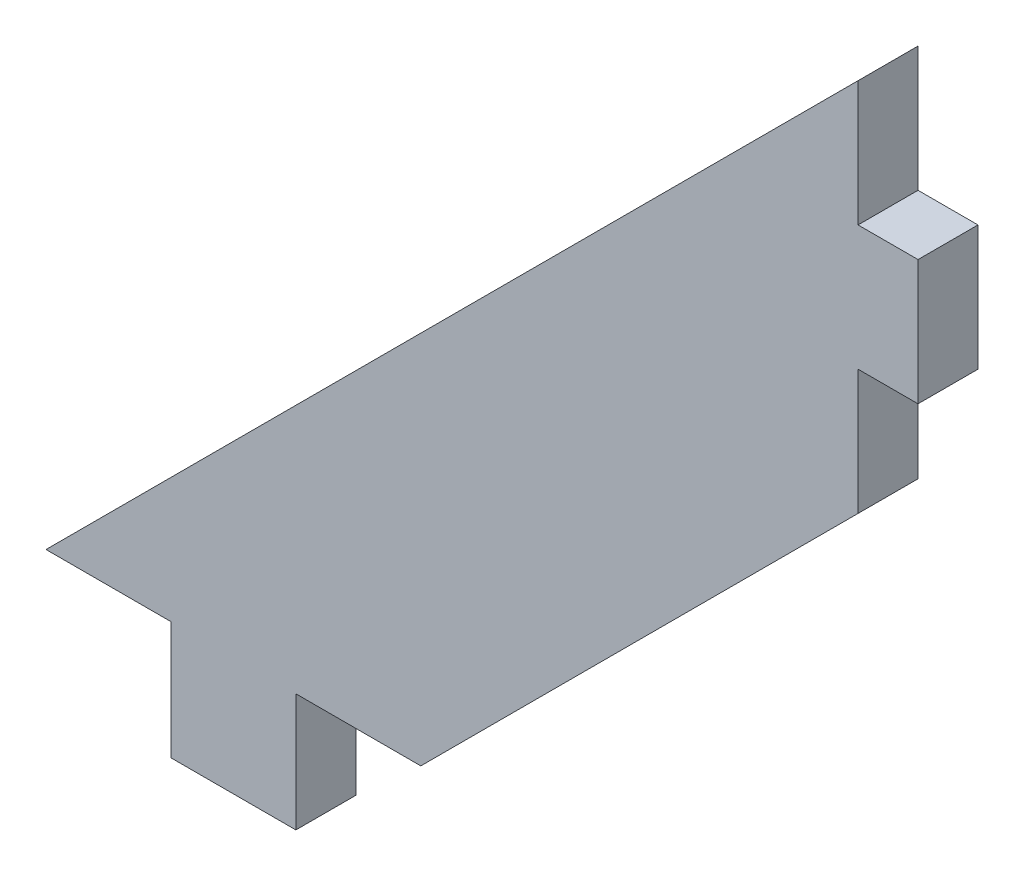
ISO-10303-21;
HEADER;
FILE_DESCRIPTION(('STEP AP214'),'2;1');
FILE_NAME('part.step','',(''),(''),'','','');
FILE_SCHEMA(('AUTOMOTIVE_DESIGN { 1 0 10303 214 1 1 1 1 }'));
ENDSEC;
DATA;
#1=APPLICATION_CONTEXT('core data for automotive mechanical design processes');
#2=APPLICATION_PROTOCOL_DEFINITION('international standard','automotive_design',2000,#1);
#3=PRODUCT_CONTEXT('',#1,'mechanical');
#4=PRODUCT('Part','Part','',(#3));
#5=PRODUCT_RELATED_PRODUCT_CATEGORY('part','',(#4));
#6=PRODUCT_DEFINITION_FORMATION('','',#4);
#7=PRODUCT_DEFINITION_CONTEXT('part definition',#1,'design');
#8=PRODUCT_DEFINITION('design','',#6,#7);
#9=PRODUCT_DEFINITION_SHAPE('','',#8);
#10=(LENGTH_UNIT() NAMED_UNIT(*) SI_UNIT(.MILLI.,.METRE.));
#11=(NAMED_UNIT(*) PLANE_ANGLE_UNIT() SI_UNIT($,.RADIAN.));
#12=(NAMED_UNIT(*) SI_UNIT($,.STERADIAN.) SOLID_ANGLE_UNIT());
#13=UNCERTAINTY_MEASURE_WITH_UNIT(LENGTH_MEASURE(1.E-05),#10,'distance_accuracy_value','');
#14=(GEOMETRIC_REPRESENTATION_CONTEXT(3) GLOBAL_UNCERTAINTY_ASSIGNED_CONTEXT((#13)) GLOBAL_UNIT_ASSIGNED_CONTEXT((#10,
#11,#12)) REPRESENTATION_CONTEXT('',''));
#15=CARTESIAN_POINT('',(0.,0.,0.));
#16=DIRECTION('',(0.,0.,1.));
#17=DIRECTION('',(1.,0.,0.));
#18=AXIS2_PLACEMENT_3D('',#15,#16,#17);
#19=CARTESIAN_POINT('',(41.2750000000003,41.275,3.048));
#20=DIRECTION('',(0.707106781186545,-0.70710678118655,0.));
#21=DIRECTION('',(0.70710678118655,0.707106781186545,0.));
#22=AXIS2_PLACEMENT_3D('',#19,#20,#21);
#23=PLANE('',#22);
#24=DIRECTION('',(-0.70710678118655,-0.707106781186545,0.));
#25=VECTOR('',#24,1.);
#26=CARTESIAN_POINT('',(41.2750000000003,41.275,0.));
#27=LINE('',#26,#25);
#28=CARTESIAN_POINT('',(41.2750000000003,41.275,0.));
#29=VERTEX_POINT('',#28);
#30=CARTESIAN_POINT('',(0.,0.,0.));
#31=VERTEX_POINT('',#30);
#32=EDGE_CURVE('E153',#29,#31,#27,.T.);
#33=ORIENTED_EDGE('',*,*,#32,.T.);
#34=DIRECTION('',(0.,0.,-1.));
#35=VECTOR('',#34,1.);
#36=CARTESIAN_POINT('',(0.,0.,3.048));
#37=LINE('',#36,#35);
#38=CARTESIAN_POINT('',(0.,0.,3.048));
#39=VERTEX_POINT('',#38);
#40=EDGE_CURVE('E11',#39,#31,#37,.T.);
#41=ORIENTED_EDGE('',*,*,#40,.F.);
#42=DIRECTION('',(-0.70710678118655,-0.707106781186545,0.));
#43=VECTOR('',#42,1.);
#44=CARTESIAN_POINT('',(41.2750000000003,41.275,3.048));
#45=LINE('',#44,#43);
#46=CARTESIAN_POINT('',(41.2750000000003,41.275,3.048));
#47=VERTEX_POINT('',#46);
#48=EDGE_CURVE('E175',#47,#39,#45,.T.);
#49=ORIENTED_EDGE('',*,*,#48,.F.);
#50=DIRECTION('',(0.,0.,-1.));
#51=VECTOR('',#50,1.);
#52=CARTESIAN_POINT('',(41.2750000000003,41.275,3.048));
#53=LINE('',#52,#51);
#54=EDGE_CURVE('E149',#47,#29,#53,.T.);
#55=ORIENTED_EDGE('',*,*,#54,.T.);
#56=EDGE_LOOP('',(#33,#41,#49,#55));
#57=FACE_BOUND('',#56,.T.);
#58=ADVANCED_FACE('F33',(#57),#23,.F.);
#59=CARTESIAN_POINT('',(0.,0.,3.048));
#60=DIRECTION('',(0.,1.,0.));
#61=DIRECTION('',(0.,0.,1.));
#62=AXIS2_PLACEMENT_3D('',#59,#60,#61);
#63=PLANE('',#62);
#64=DIRECTION('',(1.,0.,0.));
#65=VECTOR('',#64,1.);
#66=CARTESIAN_POINT('',(0.,0.,0.));
#67=LINE('',#66,#65);
#68=CARTESIAN_POINT('',(6.34999999999964,0.,0.));
#69=VERTEX_POINT('',#68);
#70=EDGE_CURVE('E156',#31,#69,#67,.T.);
#71=ORIENTED_EDGE('',*,*,#70,.T.);
#72=DIRECTION('',(0.,0.,-1.));
#73=VECTOR('',#72,1.);
#74=CARTESIAN_POINT('',(6.34999999999964,0.,3.048));
#75=LINE('',#74,#73);
#76=CARTESIAN_POINT('',(6.34999999999964,0.,3.048));
#77=VERTEX_POINT('',#76);
#78=EDGE_CURVE('E41',#77,#69,#75,.T.);
#79=ORIENTED_EDGE('',*,*,#78,.F.);
#80=DIRECTION('',(1.,0.,0.));
#81=VECTOR('',#80,1.);
#82=CARTESIAN_POINT('',(0.,0.,3.048));
#83=LINE('',#82,#81);
#84=EDGE_CURVE('E104',#39,#77,#83,.T.);
#85=ORIENTED_EDGE('',*,*,#84,.F.);
#86=ORIENTED_EDGE('',*,*,#40,.T.);
#87=EDGE_LOOP('',(#71,#79,#85,#86));
#88=FACE_BOUND('',#87,.T.);
#89=ADVANCED_FACE('F253',(#88),#63,.F.);
#90=CARTESIAN_POINT('',(6.34999999999964,0.,3.048));
#91=DIRECTION('',(1.,0.,0.));
#92=DIRECTION('',(0.,1.,0.));
#93=AXIS2_PLACEMENT_3D('',#90,#91,#92);
#94=PLANE('',#93);
#95=DIRECTION('',(0.,-1.,0.));
#96=VECTOR('',#95,1.);
#97=CARTESIAN_POINT('',(6.34999999999964,0.,0.));
#98=LINE('',#97,#96);
#99=CARTESIAN_POINT('',(6.34999999999964,-5.9944,0.));
#100=VERTEX_POINT('',#99);
#101=EDGE_CURVE('E158',#69,#100,#98,.T.);
#102=ORIENTED_EDGE('',*,*,#101,.T.);
#103=DIRECTION('',(0.,0.,-1.));
#104=VECTOR('',#103,1.);
#105=CARTESIAN_POINT('',(6.34999999999964,-5.9944,3.048));
#106=LINE('',#105,#104);
#107=CARTESIAN_POINT('',(6.34999999999964,-5.9944,3.048));
#108=VERTEX_POINT('',#107);
#109=EDGE_CURVE('E194',#108,#100,#106,.T.);
#110=ORIENTED_EDGE('',*,*,#109,.F.);
#111=DIRECTION('',(0.,-1.,0.));
#112=VECTOR('',#111,1.);
#113=CARTESIAN_POINT('',(6.34999999999964,0.,3.048));
#114=LINE('',#113,#112);
#115=EDGE_CURVE('E202',#77,#108,#114,.T.);
#116=ORIENTED_EDGE('',*,*,#115,.F.);
#117=ORIENTED_EDGE('',*,*,#78,.T.);
#118=EDGE_LOOP('',(#102,#110,#116,#117));
#119=FACE_BOUND('',#118,.T.);
#120=ADVANCED_FACE('F200',(#119),#94,.F.);
#121=CARTESIAN_POINT('',(6.34999999999964,-5.9944,3.048));
#122=DIRECTION('',(0.,1.,0.));
#123=DIRECTION('',(0.,0.,1.));
#124=AXIS2_PLACEMENT_3D('',#121,#122,#123);
#125=PLANE('',#124);
#126=DIRECTION('',(1.,0.,0.));
#127=VECTOR('',#126,1.);
#128=CARTESIAN_POINT('',(6.34999999999964,-5.9944,0.));
#129=LINE('',#128,#127);
#130=CARTESIAN_POINT('',(12.6999999999996,-5.9944,0.));
#131=VERTEX_POINT('',#130);
#132=EDGE_CURVE('E160',#100,#131,#129,.T.);
#133=ORIENTED_EDGE('',*,*,#132,.T.);
#134=DIRECTION('',(0.,0.,-1.));
#135=VECTOR('',#134,1.);
#136=CARTESIAN_POINT('',(12.6999999999996,-5.9944,3.048));
#137=LINE('',#136,#135);
#138=CARTESIAN_POINT('',(12.6999999999996,-5.9944,3.048));
#139=VERTEX_POINT('',#138);
#140=EDGE_CURVE('E191',#139,#131,#137,.T.);
#141=ORIENTED_EDGE('',*,*,#140,.F.);
#142=DIRECTION('',(1.,0.,0.));
#143=VECTOR('',#142,1.);
#144=CARTESIAN_POINT('',(6.34999999999964,-5.9944,3.048));
#145=LINE('',#144,#143);
#146=EDGE_CURVE('E220',#108,#139,#145,.T.);
#147=ORIENTED_EDGE('',*,*,#146,.F.);
#148=ORIENTED_EDGE('',*,*,#109,.T.);
#149=EDGE_LOOP('',(#133,#141,#147,#148));
#150=FACE_BOUND('',#149,.T.);
#151=ADVANCED_FACE('F211',(#150),#125,.F.);
#152=CARTESIAN_POINT('',(12.6999999999996,-5.9944,3.048));
#153=DIRECTION('',(-1.,0.,0.));
#154=DIRECTION('',(0.,0.,1.));
#155=AXIS2_PLACEMENT_3D('',#152,#153,#154);
#156=PLANE('',#155);
#157=DIRECTION('',(0.,1.,0.));
#158=VECTOR('',#157,1.);
#159=CARTESIAN_POINT('',(12.6999999999996,-5.9944,0.));
#160=LINE('',#159,#158);
#161=CARTESIAN_POINT('',(12.6999999999996,0.,0.));
#162=VERTEX_POINT('',#161);
#163=EDGE_CURVE('E162',#131,#162,#160,.T.);
#164=ORIENTED_EDGE('',*,*,#163,.T.);
#165=DIRECTION('',(0.,0.,-1.));
#166=VECTOR('',#165,1.);
#167=CARTESIAN_POINT('',(12.6999999999996,0.,3.048));
#168=LINE('',#167,#166);
#169=CARTESIAN_POINT('',(12.6999999999996,0.,3.048));
#170=VERTEX_POINT('',#169);
#171=EDGE_CURVE('E188',#170,#162,#168,.T.);
#172=ORIENTED_EDGE('',*,*,#171,.F.);
#173=DIRECTION('',(0.,1.,0.));
#174=VECTOR('',#173,1.);
#175=CARTESIAN_POINT('',(12.6999999999996,-5.9944,3.048));
#176=LINE('',#175,#174);
#177=EDGE_CURVE('E217',#139,#170,#176,.T.);
#178=ORIENTED_EDGE('',*,*,#177,.F.);
#179=ORIENTED_EDGE('',*,*,#140,.T.);
#180=EDGE_LOOP('',(#164,#172,#178,#179));
#181=FACE_BOUND('',#180,.T.);
#182=ADVANCED_FACE('F215',(#181),#156,.F.);
#183=CARTESIAN_POINT('',(12.6999999999996,0.,3.048));
#184=DIRECTION('',(0.,1.,0.));
#185=DIRECTION('',(-1.,0.,0.));
#186=AXIS2_PLACEMENT_3D('',#183,#184,#185);
#187=PLANE('',#186);
#188=DIRECTION('',(1.,0.,0.));
#189=VECTOR('',#188,1.);
#190=CARTESIAN_POINT('',(12.6999999999996,0.,0.));
#191=LINE('',#190,#189);
#192=CARTESIAN_POINT('',(19.0499999999996,0.,0.));
#193=VERTEX_POINT('',#192);
#194=EDGE_CURVE('E164',#162,#193,#191,.T.);
#195=ORIENTED_EDGE('',*,*,#194,.T.);
#196=DIRECTION('',(0.,0.,-1.));
#197=VECTOR('',#196,1.);
#198=CARTESIAN_POINT('',(19.0499999999996,0.,3.048));
#199=LINE('',#198,#197);
#200=CARTESIAN_POINT('',(19.0499999999996,0.,3.048));
#201=VERTEX_POINT('',#200);
#202=EDGE_CURVE('E185',#201,#193,#199,.T.);
#203=ORIENTED_EDGE('',*,*,#202,.F.);
#204=DIRECTION('',(1.,0.,0.));
#205=VECTOR('',#204,1.);
#206=CARTESIAN_POINT('',(12.6999999999996,0.,3.048));
#207=LINE('',#206,#205);
#208=EDGE_CURVE('E219',#170,#201,#207,.T.);
#209=ORIENTED_EDGE('',*,*,#208,.F.);
#210=ORIENTED_EDGE('',*,*,#171,.T.);
#211=EDGE_LOOP('',(#195,#203,#209,#210));
#212=FACE_BOUND('',#211,.T.);
#213=ADVANCED_FACE('F266',(#212),#187,.F.);
#214=CARTESIAN_POINT('',(19.0499999999996,0.,3.048));
#215=DIRECTION('',(-0.707106781186545,0.70710678118655,0.));
#216=DIRECTION('',(-0.70710678118655,-0.707106781186545,0.));
#217=AXIS2_PLACEMENT_3D('',#214,#215,#216);
#218=PLANE('',#217);
#219=DIRECTION('',(0.70710678118655,0.707106781186545,0.));
#220=VECTOR('',#219,1.);
#221=CARTESIAN_POINT('',(19.0499999999996,0.,0.));
#222=LINE('',#221,#220);
#223=CARTESIAN_POINT('',(41.2749999999998,22.225,0.));
#224=VERTEX_POINT('',#223);
#225=EDGE_CURVE('E166',#193,#224,#222,.T.);
#226=ORIENTED_EDGE('',*,*,#225,.T.);
#227=DIRECTION('',(0.,0.,-1.));
#228=VECTOR('',#227,1.);
#229=CARTESIAN_POINT('',(41.2749999999998,22.225,3.048));
#230=LINE('',#229,#228);
#231=CARTESIAN_POINT('',(41.2749999999998,22.225,3.048));
#232=VERTEX_POINT('',#231);
#233=EDGE_CURVE('E182',#232,#224,#230,.T.);
#234=ORIENTED_EDGE('',*,*,#233,.F.);
#235=DIRECTION('',(0.70710678118655,0.707106781186545,0.));
#236=VECTOR('',#235,1.);
#237=CARTESIAN_POINT('',(19.0499999999996,0.,3.048));
#238=LINE('',#237,#236);
#239=EDGE_CURVE('E222',#201,#232,#238,.T.);
#240=ORIENTED_EDGE('',*,*,#239,.F.);
#241=ORIENTED_EDGE('',*,*,#202,.T.);
#242=EDGE_LOOP('',(#226,#234,#240,#241));
#243=FACE_BOUND('',#242,.T.);
#244=ADVANCED_FACE('F269',(#243),#218,.F.);
#245=CARTESIAN_POINT('',(41.2749999999998,22.225,3.048));
#246=DIRECTION('',(-1.,0.,0.));
#247=DIRECTION('',(0.,-1.,0.));
#248=AXIS2_PLACEMENT_3D('',#245,#246,#247);
#249=PLANE('',#248);
#250=DIRECTION('',(0.,1.,0.));
#251=VECTOR('',#250,1.);
#252=CARTESIAN_POINT('',(41.2749999999998,22.225,0.));
#253=LINE('',#252,#251);
#254=CARTESIAN_POINT('',(41.2749999999999,28.575,0.));
#255=VERTEX_POINT('',#254);
#256=EDGE_CURVE('E168',#224,#255,#253,.T.);
#257=ORIENTED_EDGE('',*,*,#256,.T.);
#258=DIRECTION('',(0.,0.,-1.));
#259=VECTOR('',#258,1.);
#260=CARTESIAN_POINT('',(41.2749999999999,28.575,3.048));
#261=LINE('',#260,#259);
#262=CARTESIAN_POINT('',(41.2749999999999,28.575,3.048));
#263=VERTEX_POINT('',#262);
#264=EDGE_CURVE('E179',#263,#255,#261,.T.);
#265=ORIENTED_EDGE('',*,*,#264,.F.);
#266=DIRECTION('',(0.,1.,0.));
#267=VECTOR('',#266,1.);
#268=CARTESIAN_POINT('',(41.2749999999998,22.225,3.048));
#269=LINE('',#268,#267);
#270=EDGE_CURVE('E228',#232,#263,#269,.T.);
#271=ORIENTED_EDGE('',*,*,#270,.F.);
#272=ORIENTED_EDGE('',*,*,#233,.T.);
#273=EDGE_LOOP('',(#257,#265,#271,#272));
#274=FACE_BOUND('',#273,.T.);
#275=ADVANCED_FACE('F234',(#274),#249,.F.);
#276=CARTESIAN_POINT('',(41.2749999999999,28.575,3.048));
#277=DIRECTION('',(0.,1.,0.));
#278=DIRECTION('',(-1.,0.,0.));
#279=AXIS2_PLACEMENT_3D('',#276,#277,#278);
#280=PLANE('',#279);
#281=DIRECTION('',(1.,0.,0.));
#282=VECTOR('',#281,1.);
#283=CARTESIAN_POINT('',(41.2749999999999,28.575,0.));
#284=LINE('',#283,#282);
#285=CARTESIAN_POINT('',(44.3229999999999,28.575,0.));
#286=VERTEX_POINT('',#285);
#287=EDGE_CURVE('E170',#255,#286,#284,.T.);
#288=ORIENTED_EDGE('',*,*,#287,.T.);
#289=DIRECTION('',(0.,0.,-1.));
#290=VECTOR('',#289,1.);
#291=CARTESIAN_POINT('',(44.3229999999999,28.575,3.048));
#292=LINE('',#291,#290);
#293=CARTESIAN_POINT('',(44.3229999999999,28.575,3.048));
#294=VERTEX_POINT('',#293);
#295=EDGE_CURVE('E144',#294,#286,#292,.T.);
#296=ORIENTED_EDGE('',*,*,#295,.F.);
#297=DIRECTION('',(1.,0.,0.));
#298=VECTOR('',#297,1.);
#299=CARTESIAN_POINT('',(41.2749999999999,28.575,3.048));
#300=LINE('',#299,#298);
#301=EDGE_CURVE('E135',#263,#294,#300,.T.);
#302=ORIENTED_EDGE('',*,*,#301,.F.);
#303=ORIENTED_EDGE('',*,*,#264,.T.);
#304=EDGE_LOOP('',(#288,#296,#302,#303));
#305=FACE_BOUND('',#304,.T.);
#306=ADVANCED_FACE('F238',(#305),#280,.F.);
#307=CARTESIAN_POINT('',(44.3229999999999,28.575,3.048));
#308=DIRECTION('',(-1.,0.,0.));
#309=DIRECTION('',(0.,-1.,0.));
#310=AXIS2_PLACEMENT_3D('',#307,#308,#309);
#311=PLANE('',#310);
#312=DIRECTION('',(0.,1.,0.));
#313=VECTOR('',#312,1.);
#314=CARTESIAN_POINT('',(44.3229999999999,28.575,0.));
#315=LINE('',#314,#313);
#316=CARTESIAN_POINT('',(44.3229999999998,34.925,0.));
#317=VERTEX_POINT('',#316);
#318=EDGE_CURVE('E143',#286,#317,#315,.T.);
#319=ORIENTED_EDGE('',*,*,#318,.T.);
#320=DIRECTION('',(0.,0.,-1.));
#321=VECTOR('',#320,1.);
#322=CARTESIAN_POINT('',(44.3229999999998,34.925,3.048));
#323=LINE('',#322,#321);
#324=CARTESIAN_POINT('',(44.3229999999998,34.925,3.048));
#325=VERTEX_POINT('',#324);
#326=EDGE_CURVE('E140',#325,#317,#323,.T.);
#327=ORIENTED_EDGE('',*,*,#326,.F.);
#328=DIRECTION('',(0.,1.,0.));
#329=VECTOR('',#328,1.);
#330=CARTESIAN_POINT('',(44.3229999999999,28.575,3.048));
#331=LINE('',#330,#329);
#332=EDGE_CURVE('E129',#294,#325,#331,.T.);
#333=ORIENTED_EDGE('',*,*,#332,.F.);
#334=ORIENTED_EDGE('',*,*,#295,.T.);
#335=EDGE_LOOP('',(#319,#327,#333,#334));
#336=FACE_BOUND('',#335,.T.);
#337=ADVANCED_FACE('F141',(#336),#311,.F.);
#338=CARTESIAN_POINT('',(44.3229999999998,34.925,3.048));
#339=DIRECTION('',(0.,-1.,0.));
#340=DIRECTION('',(1.,0.,0.));
#341=AXIS2_PLACEMENT_3D('',#338,#339,#340);
#342=PLANE('',#341);
#343=DIRECTION('',(-1.,0.,0.));
#344=VECTOR('',#343,1.);
#345=CARTESIAN_POINT('',(44.3229999999998,34.925,0.));
#346=LINE('',#345,#344);
#347=CARTESIAN_POINT('',(41.2749999999998,34.925,0.));
#348=VERTEX_POINT('',#347);
#349=EDGE_CURVE('E90',#317,#348,#346,.T.);
#350=ORIENTED_EDGE('',*,*,#349,.T.);
#351=DIRECTION('',(0.,0.,-1.));
#352=VECTOR('',#351,1.);
#353=CARTESIAN_POINT('',(41.2749999999998,34.925,3.048));
#354=LINE('',#353,#352);
#355=CARTESIAN_POINT('',(41.2749999999998,34.925,3.048));
#356=VERTEX_POINT('',#355);
#357=EDGE_CURVE('E145',#356,#348,#354,.T.);
#358=ORIENTED_EDGE('',*,*,#357,.F.);
#359=DIRECTION('',(-1.,0.,0.));
#360=VECTOR('',#359,1.);
#361=CARTESIAN_POINT('',(44.3229999999998,34.925,3.048));
#362=LINE('',#361,#360);
#363=EDGE_CURVE('E133',#325,#356,#362,.T.);
#364=ORIENTED_EDGE('',*,*,#363,.F.);
#365=ORIENTED_EDGE('',*,*,#326,.T.);
#366=EDGE_LOOP('',(#350,#358,#364,#365));
#367=FACE_BOUND('',#366,.T.);
#368=ADVANCED_FACE('F147',(#367),#342,.F.);
#369=CARTESIAN_POINT('',(41.2749999999998,34.925,3.048));
#370=DIRECTION('',(-1.,0.,0.));
#371=DIRECTION('',(0.,-1.,0.));
#372=AXIS2_PLACEMENT_3D('',#369,#370,#371);
#373=PLANE('',#372);
#374=DIRECTION('',(0.,1.,0.));
#375=VECTOR('',#374,1.);
#376=CARTESIAN_POINT('',(41.2749999999998,34.925,0.));
#377=LINE('',#376,#375);
#378=EDGE_CURVE('E96',#348,#29,#377,.T.);
#379=ORIENTED_EDGE('',*,*,#378,.T.);
#380=ORIENTED_EDGE('',*,*,#54,.F.);
#381=DIRECTION('',(0.,1.,0.));
#382=VECTOR('',#381,1.);
#383=CARTESIAN_POINT('',(41.2749999999998,34.925,3.048));
#384=LINE('',#383,#382);
#385=EDGE_CURVE('E49',#356,#47,#384,.T.);
#386=ORIENTED_EDGE('',*,*,#385,.F.);
#387=ORIENTED_EDGE('',*,*,#357,.T.);
#388=EDGE_LOOP('',(#379,#380,#386,#387));
#389=FACE_BOUND('',#388,.T.);
#390=ADVANCED_FACE('F242',(#389),#373,.F.);
#391=CARTESIAN_POINT('',(0.,0.,3.048));
#392=DIRECTION('',(0.,0.,1.));
#393=DIRECTION('',(1.,0.,0.));
#394=AXIS2_PLACEMENT_3D('',#391,#392,#393);
#395=PLANE('',#394);
#396=ORIENTED_EDGE('',*,*,#48,.T.);
#397=ORIENTED_EDGE('',*,*,#84,.T.);
#398=ORIENTED_EDGE('',*,*,#115,.T.);
#399=ORIENTED_EDGE('',*,*,#146,.T.);
#400=ORIENTED_EDGE('',*,*,#177,.T.);
#401=ORIENTED_EDGE('',*,*,#208,.T.);
#402=ORIENTED_EDGE('',*,*,#239,.T.);
#403=ORIENTED_EDGE('',*,*,#270,.T.);
#404=ORIENTED_EDGE('',*,*,#301,.T.);
#405=ORIENTED_EDGE('',*,*,#332,.T.);
#406=ORIENTED_EDGE('',*,*,#363,.T.);
#407=ORIENTED_EDGE('',*,*,#385,.T.);
#408=EDGE_LOOP('',(#396,#397,#398,#399,#400,#401,#402,#403,#404,#405,#406,#407));
#409=FACE_BOUND('',#408,.T.);
#410=ADVANCED_FACE('F131',(#409),#395,.T.);
#411=CARTESIAN_POINT('',(0.,0.,0.));
#412=DIRECTION('',(0.,0.,1.));
#413=DIRECTION('',(1.,0.,0.));
#414=AXIS2_PLACEMENT_3D('',#411,#412,#413);
#415=PLANE('',#414);
#416=ORIENTED_EDGE('',*,*,#32,.F.);
#417=ORIENTED_EDGE('',*,*,#378,.F.);
#418=ORIENTED_EDGE('',*,*,#349,.F.);
#419=ORIENTED_EDGE('',*,*,#318,.F.);
#420=ORIENTED_EDGE('',*,*,#287,.F.);
#421=ORIENTED_EDGE('',*,*,#256,.F.);
#422=ORIENTED_EDGE('',*,*,#225,.F.);
#423=ORIENTED_EDGE('',*,*,#194,.F.);
#424=ORIENTED_EDGE('',*,*,#163,.F.);
#425=ORIENTED_EDGE('',*,*,#132,.F.);
#426=ORIENTED_EDGE('',*,*,#101,.F.);
#427=ORIENTED_EDGE('',*,*,#70,.F.);
#428=EDGE_LOOP('',(#416,#417,#418,#419,#420,#421,#422,#423,#424,#425,#426,#427));
#429=FACE_BOUND('',#428,.T.);
#430=ADVANCED_FACE('F206',(#429),#415,.F.);
#431=CLOSED_SHELL('',(#58,#89,#120,#151,#182,#213,#244,#275,#306,#337,#368,#390,#410,#430));
#432=MANIFOLD_SOLID_BREP('B2',#431);
#433=ADVANCED_BREP_SHAPE_REPRESENTATION('',(#18,#432),#14);
#434=SHAPE_DEFINITION_REPRESENTATION(#9,#433);
ENDSEC;
END-ISO-10303-21;
